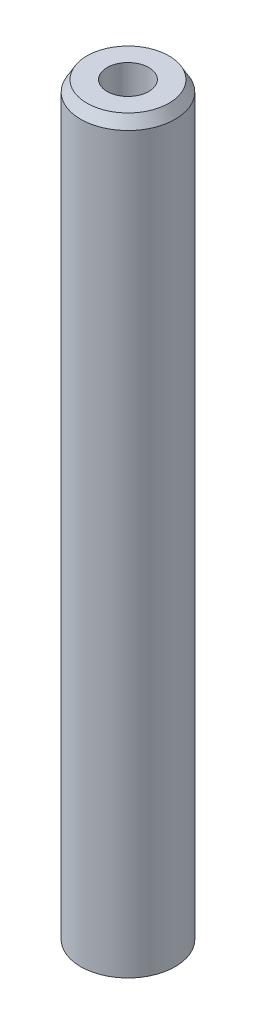
ISO-10303-21;
HEADER;
FILE_DESCRIPTION(('STEP AP214'),'2;1');
FILE_NAME('part.step','',(''),(''),'','','');
FILE_SCHEMA(('AUTOMOTIVE_DESIGN { 1 0 10303 214 1 1 1 1 }'));
ENDSEC;
DATA;
#1=APPLICATION_CONTEXT('core data for automotive mechanical design processes');
#2=APPLICATION_PROTOCOL_DEFINITION('international standard','automotive_design',2000,#1);
#3=PRODUCT_CONTEXT('',#1,'mechanical');
#4=PRODUCT('Part','Part','',(#3));
#5=PRODUCT_RELATED_PRODUCT_CATEGORY('part','',(#4));
#6=PRODUCT_DEFINITION_FORMATION('','',#4);
#7=PRODUCT_DEFINITION_CONTEXT('part definition',#1,'design');
#8=PRODUCT_DEFINITION('design','',#6,#7);
#9=PRODUCT_DEFINITION_SHAPE('','',#8);
#10=(LENGTH_UNIT() NAMED_UNIT(*) SI_UNIT(.MILLI.,.METRE.));
#11=(NAMED_UNIT(*) PLANE_ANGLE_UNIT() SI_UNIT($,.RADIAN.));
#12=(NAMED_UNIT(*) SI_UNIT($,.STERADIAN.) SOLID_ANGLE_UNIT());
#13=UNCERTAINTY_MEASURE_WITH_UNIT(LENGTH_MEASURE(1.E-05),#10,'distance_accuracy_value','');
#14=(GEOMETRIC_REPRESENTATION_CONTEXT(3) GLOBAL_UNCERTAINTY_ASSIGNED_CONTEXT((#13)) GLOBAL_UNIT_ASSIGNED_CONTEXT((#10,
#11,#12)) REPRESENTATION_CONTEXT('',''));
#15=CARTESIAN_POINT('',(0.,0.,0.));
#16=DIRECTION('',(0.,0.,1.));
#17=DIRECTION('',(1.,0.,0.));
#18=AXIS2_PLACEMENT_3D('',#15,#16,#17);
#19=CARTESIAN_POINT('',(0.,317.721940364513,0.));
#20=DIRECTION('',(0.,-1.,0.));
#21=DIRECTION('',(0.,0.,-1.));
#22=AXIS2_PLACEMENT_3D('',#19,#20,#21);
#23=CYLINDRICAL_SURFACE('',#22,20.);
#24=CARTESIAN_POINT('',(0.,313.147903586704,0.));
#25=DIRECTION('',(0.,1.,0.));
#26=DIRECTION('',(0.,0.,1.));
#27=AXIS2_PLACEMENT_3D('',#24,#25,#26);
#28=CIRCLE('',#27,20.);
#29=CARTESIAN_POINT('',(0.,313.147903586704,20.));
#30=VERTEX_POINT('',#29);
#31=EDGE_CURVE('E50',#30,#30,#28,.F.);
#32=ORIENTED_EDGE('',*,*,#31,.T.);
#33=EDGE_LOOP('',(#32));
#34=FACE_BOUND('',#33,.T.);
#35=CARTESIAN_POINT('',(0.,2.6408213649517,0.));
#36=DIRECTION('',(0.,1.,0.));
#37=DIRECTION('',(0.,0.,1.));
#38=AXIS2_PLACEMENT_3D('',#35,#36,#37);
#39=CIRCLE('',#38,20.);
#40=CARTESIAN_POINT('',(0.,2.6408213649517,20.));
#41=VERTEX_POINT('',#40);
#42=EDGE_CURVE('E51',#41,#41,#39,.T.);
#43=ORIENTED_EDGE('',*,*,#42,.T.);
#44=EDGE_LOOP('',(#43));
#45=FACE_BOUND('',#44,.T.);
#46=ADVANCED_FACE('F39',(#34,#45),#23,.T.);
#47=CARTESIAN_POINT('',(0.,317.721940364513,0.));
#48=DIRECTION('',(0.,1.,0.));
#49=DIRECTION('',(0.,0.,1.));
#50=AXIS2_PLACEMENT_3D('',#47,#48,#49);
#51=PLANE('',#50);
#52=CARTESIAN_POINT('',(0.,317.721940364513,0.));
#53=DIRECTION('',(0.,1.,0.));
#54=DIRECTION('',(0.,0.,1.));
#55=AXIS2_PLACEMENT_3D('',#52,#53,#54);
#56=CIRCLE('',#55,17.3591786350483);
#57=CARTESIAN_POINT('',(0.,317.721940364513,17.3591786350483));
#58=VERTEX_POINT('',#57);
#59=EDGE_CURVE('E54',#58,#58,#56,.T.);
#60=ORIENTED_EDGE('',*,*,#59,.T.);
#61=EDGE_LOOP('',(#60));
#62=FACE_BOUND('',#61,.T.);
#63=CARTESIAN_POINT('',(0.,317.721940364513,0.));
#64=DIRECTION('',(0.,1.,0.));
#65=DIRECTION('',(0.,0.,1.));
#66=AXIS2_PLACEMENT_3D('',#63,#64,#65);
#67=CIRCLE('',#66,8.80791779526465);
#68=CARTESIAN_POINT('',(0.,317.721940364513,8.80791779526465));
#69=VERTEX_POINT('',#68);
#70=EDGE_CURVE('E58',#69,#69,#67,.T.);
#71=ORIENTED_EDGE('',*,*,#70,.F.);
#72=EDGE_LOOP('',(#71));
#73=FACE_BOUND('',#72,.T.);
#74=ADVANCED_FACE('F69',(#62,#73),#51,.T.);
#75=CARTESIAN_POINT('',(0.,0.,0.));
#76=DIRECTION('',(0.,1.,0.));
#77=DIRECTION('',(0.,0.,1.));
#78=AXIS2_PLACEMENT_3D('',#75,#76,#77);
#79=PLANE('',#78);
#80=CARTESIAN_POINT('',(0.,0.,0.));
#81=DIRECTION('',(0.,1.,0.));
#82=DIRECTION('',(0.,0.,1.));
#83=AXIS2_PLACEMENT_3D('',#80,#81,#82);
#84=CIRCLE('',#83,15.4259632221901);
#85=CARTESIAN_POINT('',(0.,0.,15.4259632221901));
#86=VERTEX_POINT('',#85);
#87=EDGE_CURVE('E10',#86,#86,#84,.F.);
#88=ORIENTED_EDGE('',*,*,#87,.T.);
#89=EDGE_LOOP('',(#88));
#90=FACE_BOUND('',#89,.T.);
#91=CARTESIAN_POINT('',(0.,0.,0.));
#92=DIRECTION('',(0.,1.,0.));
#93=DIRECTION('',(0.,0.,1.));
#94=AXIS2_PLACEMENT_3D('',#91,#92,#93);
#95=CIRCLE('',#94,8.80791779526465);
#96=CARTESIAN_POINT('',(0.,0.,8.80791779526465));
#97=VERTEX_POINT('',#96);
#98=EDGE_CURVE('E63',#97,#97,#95,.T.);
#99=ORIENTED_EDGE('',*,*,#98,.T.);
#100=EDGE_LOOP('',(#99));
#101=FACE_BOUND('',#100,.T.);
#102=ADVANCED_FACE('F75',(#90,#101),#79,.F.);
#103=CARTESIAN_POINT('',(0.,317.721940364513,0.));
#104=DIRECTION('',(0.,-1.,0.));
#105=DIRECTION('',(0.,0.,-1.));
#106=AXIS2_PLACEMENT_3D('',#103,#104,#105);
#107=CYLINDRICAL_SURFACE('',#106,8.80791779526465);
#108=ORIENTED_EDGE('',*,*,#70,.T.);
#109=EDGE_LOOP('',(#108));
#110=FACE_BOUND('',#109,.T.);
#111=ORIENTED_EDGE('',*,*,#98,.F.);
#112=EDGE_LOOP('',(#111));
#113=FACE_BOUND('',#112,.T.);
#114=ADVANCED_FACE('F70',(#110,#113),#107,.F.);
#115=CARTESIAN_POINT('',(0.,317.721940364513,0.));
#116=DIRECTION('',(0.,-1.,0.));
#117=DIRECTION('',(0.,0.,-1.));
#118=AXIS2_PLACEMENT_3D('',#115,#116,#117);
#119=CONICAL_SURFACE('',#118,17.3591786350483,0.523598775598302);
#120=ORIENTED_EDGE('',*,*,#31,.F.);
#121=EDGE_LOOP('',(#120));
#122=FACE_BOUND('',#121,.T.);
#123=ORIENTED_EDGE('',*,*,#59,.F.);
#124=EDGE_LOOP('',(#123));
#125=FACE_BOUND('',#124,.T.);
#126=ADVANCED_FACE('F81',(#122,#125),#119,.T.);
#127=CARTESIAN_POINT('',(0.,2.6408213649517,0.));
#128=DIRECTION('',(0.,1.,0.));
#129=DIRECTION('',(0.,0.,1.));
#130=AXIS2_PLACEMENT_3D('',#127,#128,#129);
#131=CONICAL_SURFACE('',#130,20.,1.04719755119661);
#132=ORIENTED_EDGE('',*,*,#87,.F.);
#133=EDGE_LOOP('',(#132));
#134=FACE_BOUND('',#133,.T.);
#135=ORIENTED_EDGE('',*,*,#42,.F.);
#136=EDGE_LOOP('',(#135));
#137=FACE_BOUND('',#136,.T.);
#138=ADVANCED_FACE('F45',(#134,#137),#131,.T.);
#139=CLOSED_SHELL('',(#46,#74,#102,#114,#126,#138));
#140=MANIFOLD_SOLID_BREP('B2',#139);
#141=ADVANCED_BREP_SHAPE_REPRESENTATION('',(#18,#140),#14);
#142=SHAPE_DEFINITION_REPRESENTATION(#9,#141);
ENDSEC;
END-ISO-10303-21;
